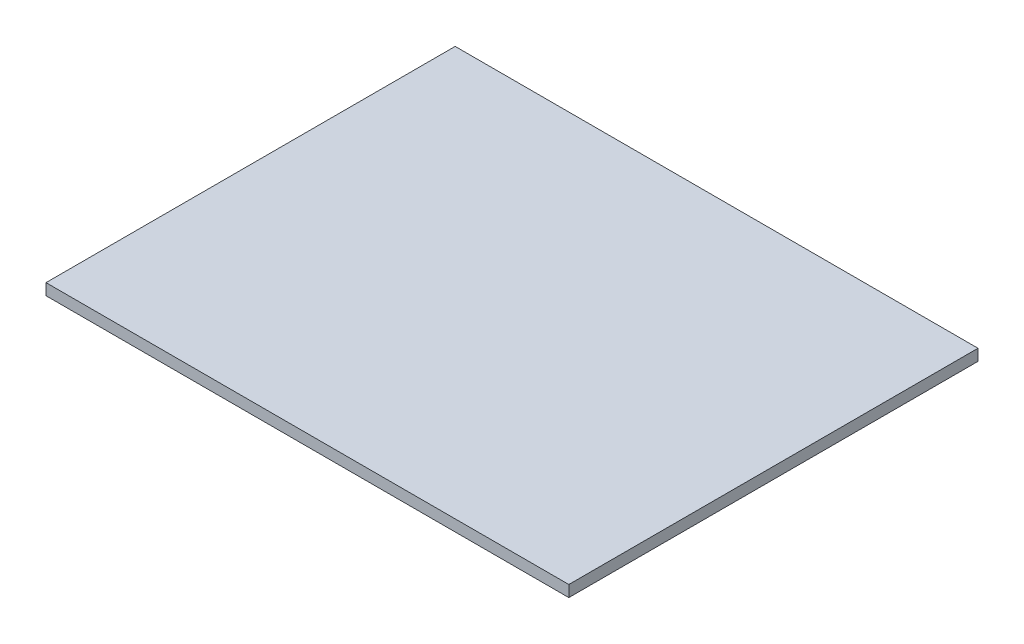
ISO-10303-21;
HEADER;
FILE_DESCRIPTION(('STEP AP214'),'2;1');
FILE_NAME('part.step','',(''),(''),'','','');
FILE_SCHEMA(('AUTOMOTIVE_DESIGN { 1 0 10303 214 1 1 1 1 }'));
ENDSEC;
DATA;
#1=APPLICATION_CONTEXT('core data for automotive mechanical design processes');
#2=APPLICATION_PROTOCOL_DEFINITION('international standard','automotive_design',2000,#1);
#3=PRODUCT_CONTEXT('',#1,'mechanical');
#4=PRODUCT('Part','Part','',(#3));
#5=PRODUCT_RELATED_PRODUCT_CATEGORY('part','',(#4));
#6=PRODUCT_DEFINITION_FORMATION('','',#4);
#7=PRODUCT_DEFINITION_CONTEXT('part definition',#1,'design');
#8=PRODUCT_DEFINITION('design','',#6,#7);
#9=PRODUCT_DEFINITION_SHAPE('','',#8);
#10=(LENGTH_UNIT() NAMED_UNIT(*) SI_UNIT(.MILLI.,.METRE.));
#11=(NAMED_UNIT(*) PLANE_ANGLE_UNIT() SI_UNIT($,.RADIAN.));
#12=(NAMED_UNIT(*) SI_UNIT($,.STERADIAN.) SOLID_ANGLE_UNIT());
#13=UNCERTAINTY_MEASURE_WITH_UNIT(LENGTH_MEASURE(1.E-05),#10,'distance_accuracy_value','');
#14=(GEOMETRIC_REPRESENTATION_CONTEXT(3) GLOBAL_UNCERTAINTY_ASSIGNED_CONTEXT((#13)) GLOBAL_UNIT_ASSIGNED_CONTEXT((#10,
#11,#12)) REPRESENTATION_CONTEXT('',''));
#15=CARTESIAN_POINT('',(0.,0.,0.));
#16=DIRECTION('',(0.,0.,1.));
#17=DIRECTION('',(1.,0.,0.));
#18=AXIS2_PLACEMENT_3D('',#15,#16,#17);
#19=CARTESIAN_POINT('',(-23.,1.,-18.));
#20=DIRECTION('',(1.,0.,0.));
#21=DIRECTION('',(0.,0.,-1.));
#22=AXIS2_PLACEMENT_3D('',#19,#20,#21);
#23=PLANE('',#22);
#24=DIRECTION('',(0.,0.,1.));
#25=VECTOR('',#24,1.);
#26=CARTESIAN_POINT('',(-23.,0.,-18.));
#27=LINE('',#26,#25);
#28=CARTESIAN_POINT('',(-23.,0.,-18.));
#29=VERTEX_POINT('',#28);
#30=CARTESIAN_POINT('',(-23.,0.,18.));
#31=VERTEX_POINT('',#30);
#32=EDGE_CURVE('E96',#29,#31,#27,.T.);
#33=ORIENTED_EDGE('',*,*,#32,.T.);
#34=DIRECTION('',(0.,-1.,0.));
#35=VECTOR('',#34,1.);
#36=CARTESIAN_POINT('',(-23.,1.,18.));
#37=LINE('',#36,#35);
#38=CARTESIAN_POINT('',(-23.,1.,18.));
#39=VERTEX_POINT('',#38);
#40=EDGE_CURVE('E11',#39,#31,#37,.T.);
#41=ORIENTED_EDGE('',*,*,#40,.F.);
#42=DIRECTION('',(0.,0.,1.));
#43=VECTOR('',#42,1.);
#44=CARTESIAN_POINT('',(-23.,1.,-18.));
#45=LINE('',#44,#43);
#46=CARTESIAN_POINT('',(-23.,1.,-18.));
#47=VERTEX_POINT('',#46);
#48=EDGE_CURVE('E84',#47,#39,#45,.T.);
#49=ORIENTED_EDGE('',*,*,#48,.F.);
#50=DIRECTION('',(0.,-1.,0.));
#51=VECTOR('',#50,1.);
#52=CARTESIAN_POINT('',(-23.,1.,-18.));
#53=LINE('',#52,#51);
#54=EDGE_CURVE('E92',#47,#29,#53,.T.);
#55=ORIENTED_EDGE('',*,*,#54,.T.);
#56=EDGE_LOOP('',(#33,#41,#49,#55));
#57=FACE_BOUND('',#56,.T.);
#58=ADVANCED_FACE('F33',(#57),#23,.F.);
#59=CARTESIAN_POINT('',(-23.,1.,18.));
#60=DIRECTION('',(0.,0.,-1.));
#61=DIRECTION('',(-1.,0.,0.));
#62=AXIS2_PLACEMENT_3D('',#59,#60,#61);
#63=PLANE('',#62);
#64=DIRECTION('',(1.,0.,0.));
#65=VECTOR('',#64,1.);
#66=CARTESIAN_POINT('',(-23.,0.,18.));
#67=LINE('',#66,#65);
#68=CARTESIAN_POINT('',(23.,0.,18.));
#69=VERTEX_POINT('',#68);
#70=EDGE_CURVE('E88',#31,#69,#67,.T.);
#71=ORIENTED_EDGE('',*,*,#70,.T.);
#72=DIRECTION('',(0.,-1.,0.));
#73=VECTOR('',#72,1.);
#74=CARTESIAN_POINT('',(23.,1.,18.));
#75=LINE('',#74,#73);
#76=CARTESIAN_POINT('',(23.,1.,18.));
#77=VERTEX_POINT('',#76);
#78=EDGE_CURVE('E41',#77,#69,#75,.T.);
#79=ORIENTED_EDGE('',*,*,#78,.F.);
#80=DIRECTION('',(1.,0.,0.));
#81=VECTOR('',#80,1.);
#82=CARTESIAN_POINT('',(-23.,1.,18.));
#83=LINE('',#82,#81);
#84=EDGE_CURVE('E79',#39,#77,#83,.T.);
#85=ORIENTED_EDGE('',*,*,#84,.F.);
#86=ORIENTED_EDGE('',*,*,#40,.T.);
#87=EDGE_LOOP('',(#71,#79,#85,#86));
#88=FACE_BOUND('',#87,.T.);
#89=ADVANCED_FACE('F87',(#88),#63,.F.);
#90=CARTESIAN_POINT('',(23.,1.,-18.));
#91=DIRECTION('',(-1.,0.,0.));
#92=DIRECTION('',(0.,0.,1.));
#93=AXIS2_PLACEMENT_3D('',#90,#91,#92);
#94=PLANE('',#93);
#95=DIRECTION('',(0.,0.,-1.));
#96=VECTOR('',#95,1.);
#97=CARTESIAN_POINT('',(23.,0.,-18.));
#98=LINE('',#97,#96);
#99=CARTESIAN_POINT('',(23.,0.,-18.));
#100=VERTEX_POINT('',#99);
#101=EDGE_CURVE('E66',#69,#100,#98,.T.);
#102=ORIENTED_EDGE('',*,*,#101,.T.);
#103=DIRECTION('',(0.,-1.,0.));
#104=VECTOR('',#103,1.);
#105=CARTESIAN_POINT('',(23.,1.,-18.));
#106=LINE('',#105,#104);
#107=CARTESIAN_POINT('',(23.,1.,-18.));
#108=VERTEX_POINT('',#107);
#109=EDGE_CURVE('E89',#108,#100,#106,.T.);
#110=ORIENTED_EDGE('',*,*,#109,.F.);
#111=DIRECTION('',(0.,0.,-1.));
#112=VECTOR('',#111,1.);
#113=CARTESIAN_POINT('',(23.,1.,-18.));
#114=LINE('',#113,#112);
#115=EDGE_CURVE('E82',#77,#108,#114,.T.);
#116=ORIENTED_EDGE('',*,*,#115,.F.);
#117=ORIENTED_EDGE('',*,*,#78,.T.);
#118=EDGE_LOOP('',(#102,#110,#116,#117));
#119=FACE_BOUND('',#118,.T.);
#120=ADVANCED_FACE('F90',(#119),#94,.F.);
#121=CARTESIAN_POINT('',(-23.,1.,-18.));
#122=DIRECTION('',(0.,0.,1.));
#123=DIRECTION('',(1.,0.,0.));
#124=AXIS2_PLACEMENT_3D('',#121,#122,#123);
#125=PLANE('',#124);
#126=DIRECTION('',(-1.,0.,0.));
#127=VECTOR('',#126,1.);
#128=CARTESIAN_POINT('',(-23.,0.,-18.));
#129=LINE('',#128,#127);
#130=EDGE_CURVE('E72',#100,#29,#129,.T.);
#131=ORIENTED_EDGE('',*,*,#130,.T.);
#132=ORIENTED_EDGE('',*,*,#54,.F.);
#133=DIRECTION('',(-1.,0.,0.));
#134=VECTOR('',#133,1.);
#135=CARTESIAN_POINT('',(-23.,1.,-18.));
#136=LINE('',#135,#134);
#137=EDGE_CURVE('E49',#108,#47,#136,.T.);
#138=ORIENTED_EDGE('',*,*,#137,.F.);
#139=ORIENTED_EDGE('',*,*,#109,.T.);
#140=EDGE_LOOP('',(#131,#132,#138,#139));
#141=FACE_BOUND('',#140,.T.);
#142=ADVANCED_FACE('F103',(#141),#125,.F.);
#143=CARTESIAN_POINT('',(0.,1.,0.));
#144=DIRECTION('',(0.,1.,0.));
#145=DIRECTION('',(0.,0.,1.));
#146=AXIS2_PLACEMENT_3D('',#143,#144,#145);
#147=PLANE('',#146);
#148=ORIENTED_EDGE('',*,*,#48,.T.);
#149=ORIENTED_EDGE('',*,*,#84,.T.);
#150=ORIENTED_EDGE('',*,*,#115,.T.);
#151=ORIENTED_EDGE('',*,*,#137,.T.);
#152=EDGE_LOOP('',(#148,#149,#150,#151));
#153=FACE_BOUND('',#152,.T.);
#154=ADVANCED_FACE('F80',(#153),#147,.T.);
#155=CARTESIAN_POINT('',(0.,0.,0.));
#156=DIRECTION('',(0.,1.,0.));
#157=DIRECTION('',(0.,0.,1.));
#158=AXIS2_PLACEMENT_3D('',#155,#156,#157);
#159=PLANE('',#158);
#160=ORIENTED_EDGE('',*,*,#32,.F.);
#161=ORIENTED_EDGE('',*,*,#130,.F.);
#162=ORIENTED_EDGE('',*,*,#101,.F.);
#163=ORIENTED_EDGE('',*,*,#70,.F.);
#164=EDGE_LOOP('',(#160,#161,#162,#163));
#165=FACE_BOUND('',#164,.T.);
#166=ADVANCED_FACE('F106',(#165),#159,.F.);
#167=CLOSED_SHELL('',(#58,#89,#120,#142,#154,#166));
#168=MANIFOLD_SOLID_BREP('B2',#167);
#169=ADVANCED_BREP_SHAPE_REPRESENTATION('',(#18,#168),#14);
#170=SHAPE_DEFINITION_REPRESENTATION(#9,#169);
ENDSEC;
END-ISO-10303-21;
